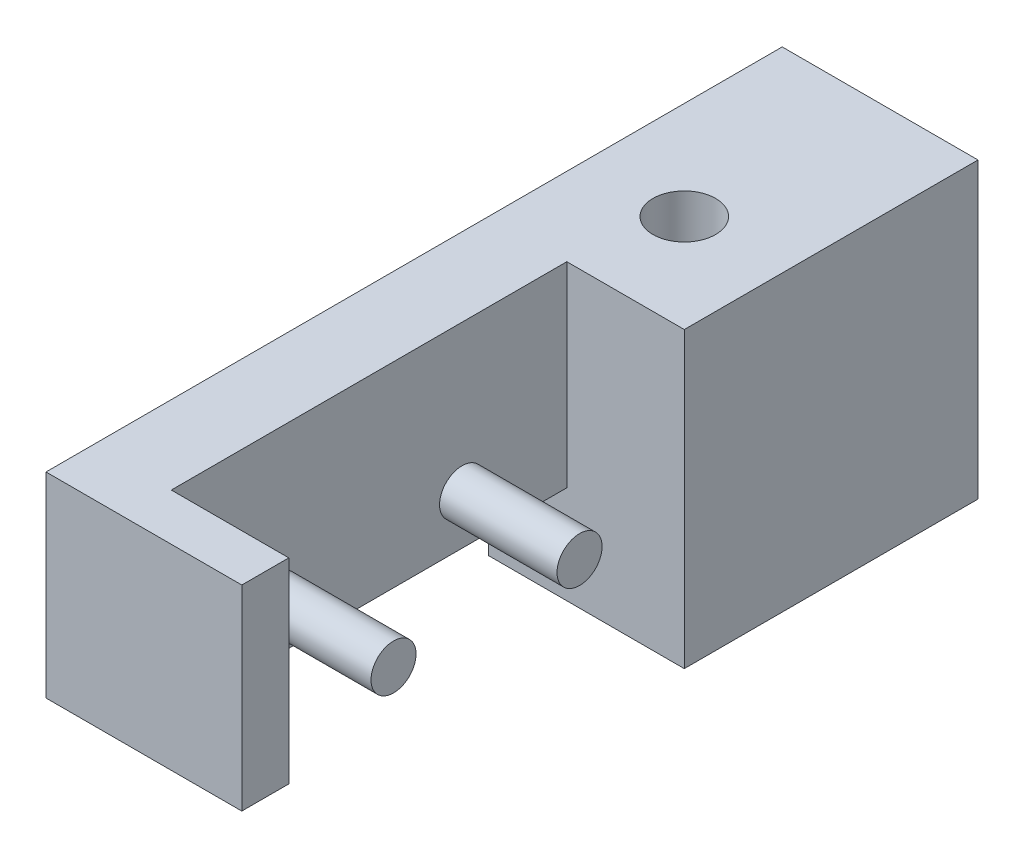
ISO-10303-21;
HEADER;
FILE_DESCRIPTION(('STEP AP214'),'2;1');
FILE_NAME('part.step','',(''),(''),'','','');
FILE_SCHEMA(('AUTOMOTIVE_DESIGN { 1 0 10303 214 1 1 1 1 }'));
ENDSEC;
DATA;
#1=APPLICATION_CONTEXT('core data for automotive mechanical design processes');
#2=APPLICATION_PROTOCOL_DEFINITION('international standard','automotive_design',2000,#1);
#3=PRODUCT_CONTEXT('',#1,'mechanical');
#4=PRODUCT('Part','Part','',(#3));
#5=PRODUCT_RELATED_PRODUCT_CATEGORY('part','',(#4));
#6=PRODUCT_DEFINITION_FORMATION('','',#4);
#7=PRODUCT_DEFINITION_CONTEXT('part definition',#1,'design');
#8=PRODUCT_DEFINITION('design','',#6,#7);
#9=PRODUCT_DEFINITION_SHAPE('','',#8);
#10=(LENGTH_UNIT() NAMED_UNIT(*) SI_UNIT(.MILLI.,.METRE.));
#11=(NAMED_UNIT(*) PLANE_ANGLE_UNIT() SI_UNIT($,.RADIAN.));
#12=(NAMED_UNIT(*) SI_UNIT($,.STERADIAN.) SOLID_ANGLE_UNIT());
#13=UNCERTAINTY_MEASURE_WITH_UNIT(LENGTH_MEASURE(1.E-05),#10,'distance_accuracy_value','');
#14=(GEOMETRIC_REPRESENTATION_CONTEXT(3) GLOBAL_UNCERTAINTY_ASSIGNED_CONTEXT((#13)) GLOBAL_UNIT_ASSIGNED_CONTEXT((#10,
#11,#12)) REPRESENTATION_CONTEXT('',''));
#15=CARTESIAN_POINT('',(0.,0.,0.));
#16=DIRECTION('',(0.,0.,1.));
#17=DIRECTION('',(1.,0.,0.));
#18=AXIS2_PLACEMENT_3D('',#15,#16,#17);
#19=CARTESIAN_POINT('',(5.,0.,0.));
#20=DIRECTION('',(1.,0.,0.));
#21=DIRECTION('',(0.,0.,-1.));
#22=AXIS2_PLACEMENT_3D('',#19,#20,#21);
#23=PLANE('',#22);
#24=DIRECTION('',(0.,-1.,0.));
#25=VECTOR('',#24,1.);
#26=CARTESIAN_POINT('',(5.,5.,20.2));
#27=LINE('',#26,#25);
#28=CARTESIAN_POINT('',(5.,15.,20.2));
#29=VERTEX_POINT('',#28);
#30=CARTESIAN_POINT('',(5.,5.,20.2));
#31=VERTEX_POINT('',#30);
#32=EDGE_CURVE('E202',#29,#31,#27,.T.);
#33=ORIENTED_EDGE('',*,*,#32,.F.);
#34=DIRECTION('',(0.,0.,1.));
#35=VECTOR('',#34,1.);
#36=CARTESIAN_POINT('',(5.,15.,-15.));
#37=LINE('',#36,#35);
#38=CARTESIAN_POINT('',(5.,15.,22.6));
#39=VERTEX_POINT('',#38);
#40=EDGE_CURVE('E115',#29,#39,#37,.T.);
#41=ORIENTED_EDGE('',*,*,#40,.T.);
#42=DIRECTION('',(0.,-1.,0.));
#43=VECTOR('',#42,1.);
#44=CARTESIAN_POINT('',(5.,15.,22.6));
#45=LINE('',#44,#43);
#46=CARTESIAN_POINT('',(5.,5.,22.6));
#47=VERTEX_POINT('',#46);
#48=EDGE_CURVE('E57',#39,#47,#45,.T.);
#49=ORIENTED_EDGE('',*,*,#48,.T.);
#50=DIRECTION('',(0.,0.,-1.));
#51=VECTOR('',#50,1.);
#52=CARTESIAN_POINT('',(5.,5.,22.6));
#53=LINE('',#52,#51);
#54=EDGE_CURVE('E138',#47,#31,#53,.T.);
#55=ORIENTED_EDGE('',*,*,#54,.T.);
#56=EDGE_LOOP('',(#33,#41,#49,#55));
#57=FACE_BOUND('',#56,.T.);
#58=ADVANCED_FACE('F39',(#57),#23,.T.);
#59=CARTESIAN_POINT('',(5.,0.,0.));
#60=DIRECTION('',(0.,1.,0.));
#61=DIRECTION('',(0.,0.,1.));
#62=AXIS2_PLACEMENT_3D('',#59,#60,#61);
#63=PLANE('',#62);
#64=CARTESIAN_POINT('',(0.,0.,-5.));
#65=DIRECTION('',(0.,-1.,0.));
#66=DIRECTION('',(0.,0.,-1.));
#67=AXIS2_PLACEMENT_3D('',#64,#65,#66);
#68=CIRCLE('',#67,1.6);
#69=CARTESIAN_POINT('',(0.,0.,-6.6));
#70=VERTEX_POINT('',#69);
#71=EDGE_CURVE('E380',#70,#70,#68,.T.);
#72=ORIENTED_EDGE('',*,*,#71,.F.);
#73=EDGE_LOOP('',(#72));
#74=FACE_BOUND('',#73,.T.);
#75=DIRECTION('',(0.,0.,-1.));
#76=VECTOR('',#75,1.);
#77=CARTESIAN_POINT('',(-5.,0.,0.));
#78=LINE('',#77,#76);
#79=CARTESIAN_POINT('',(-5.,0.,0.));
#80=VERTEX_POINT('',#79);
#81=CARTESIAN_POINT('',(-5.,0.,-15.));
#82=VERTEX_POINT('',#81);
#83=EDGE_CURVE('E144',#80,#82,#78,.T.);
#84=ORIENTED_EDGE('',*,*,#83,.T.);
#85=DIRECTION('',(-1.,0.,0.));
#86=VECTOR('',#85,1.);
#87=CARTESIAN_POINT('',(5.,0.,-15.));
#88=LINE('',#87,#86);
#89=CARTESIAN_POINT('',(5.,0.,-15.));
#90=VERTEX_POINT('',#89);
#91=EDGE_CURVE('E125',#90,#82,#88,.T.);
#92=ORIENTED_EDGE('',*,*,#91,.F.);
#93=DIRECTION('',(0.,0.,-1.));
#94=VECTOR('',#93,1.);
#95=CARTESIAN_POINT('',(5.,0.,0.));
#96=LINE('',#95,#94);
#97=CARTESIAN_POINT('',(5.,0.,0.));
#98=VERTEX_POINT('',#97);
#99=EDGE_CURVE('E96',#98,#90,#96,.T.);
#100=ORIENTED_EDGE('',*,*,#99,.F.);
#101=DIRECTION('',(-1.,0.,0.));
#102=VECTOR('',#101,1.);
#103=CARTESIAN_POINT('',(5.,0.,0.));
#104=LINE('',#103,#102);
#105=EDGE_CURVE('E171',#98,#80,#104,.T.);
#106=ORIENTED_EDGE('',*,*,#105,.T.);
#107=EDGE_LOOP('',(#84,#92,#100,#106));
#108=FACE_BOUND('',#107,.T.);
#109=ADVANCED_FACE('F41',(#74,#108),#63,.F.);
#110=CARTESIAN_POINT('',(5.,0.,-15.));
#111=DIRECTION('',(0.,0.,1.));
#112=DIRECTION('',(1.,0.,0.));
#113=AXIS2_PLACEMENT_3D('',#110,#111,#112);
#114=PLANE('',#113);
#115=DIRECTION('',(0.,1.,0.));
#116=VECTOR('',#115,1.);
#117=CARTESIAN_POINT('',(-5.,0.,-15.));
#118=LINE('',#117,#116);
#119=CARTESIAN_POINT('',(-5.,15.,-15.));
#120=VERTEX_POINT('',#119);
#121=EDGE_CURVE('E121',#82,#120,#118,.T.);
#122=ORIENTED_EDGE('',*,*,#121,.T.);
#123=DIRECTION('',(-1.,0.,0.));
#124=VECTOR('',#123,1.);
#125=CARTESIAN_POINT('',(5.,15.,-15.));
#126=LINE('',#125,#124);
#127=CARTESIAN_POINT('',(5.,15.,-15.));
#128=VERTEX_POINT('',#127);
#129=EDGE_CURVE('E118',#128,#120,#126,.T.);
#130=ORIENTED_EDGE('',*,*,#129,.F.);
#131=DIRECTION('',(0.,1.,0.));
#132=VECTOR('',#131,1.);
#133=CARTESIAN_POINT('',(5.,0.,-15.));
#134=LINE('',#133,#132);
#135=EDGE_CURVE('E106',#90,#128,#134,.T.);
#136=ORIENTED_EDGE('',*,*,#135,.F.);
#137=ORIENTED_EDGE('',*,*,#91,.T.);
#138=EDGE_LOOP('',(#122,#130,#136,#137));
#139=FACE_BOUND('',#138,.T.);
#140=ADVANCED_FACE('F119',(#139),#114,.F.);
#141=CARTESIAN_POINT('',(5.,15.,-15.));
#142=DIRECTION('',(0.,-1.,0.));
#143=DIRECTION('',(0.,0.,-1.));
#144=AXIS2_PLACEMENT_3D('',#141,#142,#143);
#145=PLANE('',#144);
#146=CARTESIAN_POINT('',(0.,15.,-5.));
#147=DIRECTION('',(0.,-1.,0.));
#148=DIRECTION('',(0.,0.,-1.));
#149=AXIS2_PLACEMENT_3D('',#146,#147,#148);
#150=CIRCLE('',#149,1.6);
#151=CARTESIAN_POINT('',(0.,15.,-6.6));
#152=VERTEX_POINT('',#151);
#153=EDGE_CURVE('E383',#152,#152,#150,.F.);
#154=ORIENTED_EDGE('',*,*,#153,.F.);
#155=EDGE_LOOP('',(#154));
#156=FACE_BOUND('',#155,.T.);
#157=ORIENTED_EDGE('',*,*,#40,.F.);
#158=DIRECTION('',(1.,0.,0.));
#159=VECTOR('',#158,1.);
#160=CARTESIAN_POINT('',(-1.,15.,20.2));
#161=LINE('',#160,#159);
#162=CARTESIAN_POINT('',(-1.,15.,20.2));
#163=VERTEX_POINT('',#162);
#164=EDGE_CURVE('E147',#163,#29,#161,.T.);
#165=ORIENTED_EDGE('',*,*,#164,.F.);
#166=DIRECTION('',(0.,0.,1.));
#167=VECTOR('',#166,1.);
#168=CARTESIAN_POINT('',(-1.,15.,20.2));
#169=LINE('',#168,#167);
#170=CARTESIAN_POINT('',(-1.,15.,0.));
#171=VERTEX_POINT('',#170);
#172=EDGE_CURVE('E195',#171,#163,#169,.T.);
#173=ORIENTED_EDGE('',*,*,#172,.F.);
#174=DIRECTION('',(1.,0.,0.));
#175=VECTOR('',#174,1.);
#176=CARTESIAN_POINT('',(-1.,15.,0.));
#177=LINE('',#176,#175);
#178=CARTESIAN_POINT('',(5.,15.,0.));
#179=VERTEX_POINT('',#178);
#180=EDGE_CURVE('E133',#171,#179,#177,.T.);
#181=ORIENTED_EDGE('',*,*,#180,.T.);
#182=EDGE_CURVE('E111',#128,#179,#37,.T.);
#183=ORIENTED_EDGE('',*,*,#182,.F.);
#184=ORIENTED_EDGE('',*,*,#129,.T.);
#185=DIRECTION('',(0.,0.,1.));
#186=VECTOR('',#185,1.);
#187=CARTESIAN_POINT('',(-5.,15.,-15.));
#188=LINE('',#187,#186);
#189=CARTESIAN_POINT('',(-5.,15.,22.6));
#190=VERTEX_POINT('',#189);
#191=EDGE_CURVE('E150',#120,#190,#188,.T.);
#192=ORIENTED_EDGE('',*,*,#191,.T.);
#193=DIRECTION('',(-1.,0.,0.));
#194=VECTOR('',#193,1.);
#195=CARTESIAN_POINT('',(5.,15.,22.6));
#196=LINE('',#195,#194);
#197=EDGE_CURVE('E126',#39,#190,#196,.T.);
#198=ORIENTED_EDGE('',*,*,#197,.F.);
#199=EDGE_LOOP('',(#157,#165,#173,#181,#183,#184,#192,#198));
#200=FACE_BOUND('',#199,.T.);
#201=ADVANCED_FACE('F130',(#156,#200),#145,.F.);
#202=CARTESIAN_POINT('',(5.,15.,22.6));
#203=DIRECTION('',(0.,0.,-1.));
#204=DIRECTION('',(0.,1.,0.));
#205=AXIS2_PLACEMENT_3D('',#202,#203,#204);
#206=PLANE('',#205);
#207=DIRECTION('',(0.,-1.,0.));
#208=VECTOR('',#207,1.);
#209=CARTESIAN_POINT('',(-5.,15.,22.6));
#210=LINE('',#209,#208);
#211=CARTESIAN_POINT('',(-5.,5.,22.6));
#212=VERTEX_POINT('',#211);
#213=EDGE_CURVE('E80',#190,#212,#210,.T.);
#214=ORIENTED_EDGE('',*,*,#213,.T.);
#215=DIRECTION('',(-1.,0.,0.));
#216=VECTOR('',#215,1.);
#217=CARTESIAN_POINT('',(5.,5.,22.6));
#218=LINE('',#217,#216);
#219=EDGE_CURVE('E164',#47,#212,#218,.T.);
#220=ORIENTED_EDGE('',*,*,#219,.F.);
#221=ORIENTED_EDGE('',*,*,#48,.F.);
#222=ORIENTED_EDGE('',*,*,#197,.T.);
#223=EDGE_LOOP('',(#214,#220,#221,#222));
#224=FACE_BOUND('',#223,.T.);
#225=ADVANCED_FACE('F240',(#224),#206,.F.);
#226=CARTESIAN_POINT('',(5.,5.,22.6));
#227=DIRECTION('',(0.,1.,0.));
#228=DIRECTION('',(0.,0.,1.));
#229=AXIS2_PLACEMENT_3D('',#226,#227,#228);
#230=PLANE('',#229);
#231=DIRECTION('',(0.,0.,-1.));
#232=VECTOR('',#231,1.);
#233=CARTESIAN_POINT('',(-1.,5.,20.2));
#234=LINE('',#233,#232);
#235=CARTESIAN_POINT('',(-1.,5.,20.2));
#236=VERTEX_POINT('',#235);
#237=CARTESIAN_POINT('',(-1.,5.,0.));
#238=VERTEX_POINT('',#237);
#239=EDGE_CURVE('E194',#236,#238,#234,.T.);
#240=ORIENTED_EDGE('',*,*,#239,.F.);
#241=DIRECTION('',(1.,0.,0.));
#242=VECTOR('',#241,1.);
#243=CARTESIAN_POINT('',(-1.,5.,20.2));
#244=LINE('',#243,#242);
#245=EDGE_CURVE('E209',#236,#31,#244,.T.);
#246=ORIENTED_EDGE('',*,*,#245,.T.);
#247=ORIENTED_EDGE('',*,*,#54,.F.);
#248=ORIENTED_EDGE('',*,*,#219,.T.);
#249=DIRECTION('',(0.,0.,-1.));
#250=VECTOR('',#249,1.);
#251=CARTESIAN_POINT('',(-5.,5.,22.6));
#252=LINE('',#251,#250);
#253=CARTESIAN_POINT('',(-5.,5.,0.));
#254=VERTEX_POINT('',#253);
#255=EDGE_CURVE('E155',#212,#254,#252,.T.);
#256=ORIENTED_EDGE('',*,*,#255,.T.);
#257=DIRECTION('',(-1.,0.,0.));
#258=VECTOR('',#257,1.);
#259=CARTESIAN_POINT('',(5.,5.,0.));
#260=LINE('',#259,#258);
#261=EDGE_CURVE('E87',#238,#254,#260,.T.);
#262=ORIENTED_EDGE('',*,*,#261,.F.);
#263=EDGE_LOOP('',(#240,#246,#247,#248,#256,#262));
#264=FACE_BOUND('',#263,.T.);
#265=ADVANCED_FACE('F206',(#264),#230,.F.);
#266=CARTESIAN_POINT('',(5.,5.,0.));
#267=DIRECTION('',(0.,0.,-1.));
#268=DIRECTION('',(-1.,0.,0.));
#269=AXIS2_PLACEMENT_3D('',#266,#267,#268);
#270=PLANE('',#269);
#271=DIRECTION('',(0.,-1.,0.));
#272=VECTOR('',#271,1.);
#273=CARTESIAN_POINT('',(-5.,5.,0.));
#274=LINE('',#273,#272);
#275=EDGE_CURVE('E158',#254,#80,#274,.T.);
#276=ORIENTED_EDGE('',*,*,#275,.T.);
#277=ORIENTED_EDGE('',*,*,#105,.F.);
#278=DIRECTION('',(0.,-1.,0.));
#279=VECTOR('',#278,1.);
#280=CARTESIAN_POINT('',(5.,4.,0.));
#281=LINE('',#280,#279);
#282=EDGE_CURVE('E161',#179,#98,#281,.T.);
#283=ORIENTED_EDGE('',*,*,#282,.F.);
#284=ORIENTED_EDGE('',*,*,#180,.F.);
#285=DIRECTION('',(0.,1.,0.));
#286=VECTOR('',#285,1.);
#287=CARTESIAN_POINT('',(-1.,5.,0.));
#288=LINE('',#287,#286);
#289=EDGE_CURVE('E211',#238,#171,#288,.T.);
#290=ORIENTED_EDGE('',*,*,#289,.F.);
#291=ORIENTED_EDGE('',*,*,#261,.T.);
#292=EDGE_LOOP('',(#276,#277,#283,#284,#290,#291));
#293=FACE_BOUND('',#292,.T.);
#294=ADVANCED_FACE('F233',(#293),#270,.F.);
#295=ORIENTED_EDGE('',*,*,#182,.T.);
#296=ORIENTED_EDGE('',*,*,#282,.T.);
#297=ORIENTED_EDGE('',*,*,#99,.T.);
#298=ORIENTED_EDGE('',*,*,#135,.T.);
#299=EDGE_LOOP('',(#295,#296,#297,#298));
#300=FACE_BOUND('',#299,.T.);
#301=ADVANCED_FACE('F108',(#300),#23,.T.);
#302=CARTESIAN_POINT('',(-5.,0.,0.));
#303=DIRECTION('',(1.,0.,0.));
#304=DIRECTION('',(0.,0.,-1.));
#305=AXIS2_PLACEMENT_3D('',#302,#303,#304);
#306=PLANE('',#305);
#307=ORIENTED_EDGE('',*,*,#83,.F.);
#308=ORIENTED_EDGE('',*,*,#275,.F.);
#309=ORIENTED_EDGE('',*,*,#255,.F.);
#310=ORIENTED_EDGE('',*,*,#213,.F.);
#311=ORIENTED_EDGE('',*,*,#191,.F.);
#312=ORIENTED_EDGE('',*,*,#121,.F.);
#313=EDGE_LOOP('',(#307,#308,#309,#310,#311,#312));
#314=FACE_BOUND('',#313,.T.);
#315=ADVANCED_FACE('F237',(#314),#306,.F.);
#316=CARTESIAN_POINT('',(-1.,5.,20.2));
#317=DIRECTION('',(0.,0.,1.));
#318=DIRECTION('',(1.,0.,0.));
#319=AXIS2_PLACEMENT_3D('',#316,#317,#318);
#320=PLANE('',#319);
#321=ORIENTED_EDGE('',*,*,#32,.T.);
#322=ORIENTED_EDGE('',*,*,#245,.F.);
#323=DIRECTION('',(0.,-1.,0.));
#324=VECTOR('',#323,1.);
#325=CARTESIAN_POINT('',(-1.,5.,20.2));
#326=LINE('',#325,#324);
#327=EDGE_CURVE('E190',#163,#236,#326,.T.);
#328=ORIENTED_EDGE('',*,*,#327,.F.);
#329=ORIENTED_EDGE('',*,*,#164,.T.);
#330=EDGE_LOOP('',(#321,#322,#328,#329));
#331=FACE_BOUND('',#330,.T.);
#332=ADVANCED_FACE('F182',(#331),#320,.F.);
#333=CARTESIAN_POINT('',(-1.,0.,0.));
#334=DIRECTION('',(-1.,0.,0.));
#335=DIRECTION('',(0.,0.,1.));
#336=AXIS2_PLACEMENT_3D('',#333,#334,#335);
#337=PLANE('',#336);
#338=CARTESIAN_POINT('',(-1.,7.5,5.35000000000001));
#339=DIRECTION('',(-1.,0.,0.));
#340=DIRECTION('',(0.,0.,1.));
#341=AXIS2_PLACEMENT_3D('',#338,#339,#340);
#342=CIRCLE('',#341,1.15);
#343=CARTESIAN_POINT('',(-1.,7.5,6.50000000000001));
#344=VERTEX_POINT('',#343);
#345=EDGE_CURVE('E11',#344,#344,#342,.F.);
#346=ORIENTED_EDGE('',*,*,#345,.F.);
#347=EDGE_LOOP('',(#346));
#348=FACE_BOUND('',#347,.T.);
#349=CARTESIAN_POINT('',(-1.,7.5,14.85));
#350=DIRECTION('',(-1.,0.,0.));
#351=DIRECTION('',(0.,0.,1.));
#352=AXIS2_PLACEMENT_3D('',#349,#350,#351);
#353=CIRCLE('',#352,1.15);
#354=CARTESIAN_POINT('',(-1.,7.5,16.));
#355=VERTEX_POINT('',#354);
#356=EDGE_CURVE('E49',#355,#355,#353,.F.);
#357=ORIENTED_EDGE('',*,*,#356,.F.);
#358=EDGE_LOOP('',(#357));
#359=FACE_BOUND('',#358,.T.);
#360=ORIENTED_EDGE('',*,*,#327,.T.);
#361=ORIENTED_EDGE('',*,*,#239,.T.);
#362=ORIENTED_EDGE('',*,*,#289,.T.);
#363=ORIENTED_EDGE('',*,*,#172,.T.);
#364=EDGE_LOOP('',(#360,#361,#362,#363));
#365=FACE_BOUND('',#364,.T.);
#366=ADVANCED_FACE('F179',(#348,#359,#365),#337,.F.);
#367=CARTESIAN_POINT('',(5.,7.5,14.85));
#368=DIRECTION('',(-1.,0.,0.));
#369=DIRECTION('',(0.,0.,1.));
#370=AXIS2_PLACEMENT_3D('',#367,#368,#369);
#371=CYLINDRICAL_SURFACE('',#370,1.15);
#372=CARTESIAN_POINT('',(5.,7.5,14.85));
#373=DIRECTION('',(1.,0.,0.));
#374=DIRECTION('',(0.,0.,-1.));
#375=AXIS2_PLACEMENT_3D('',#372,#373,#374);
#376=CIRCLE('',#375,1.15);
#377=CARTESIAN_POINT('',(5.,7.5,13.7));
#378=VERTEX_POINT('',#377);
#379=EDGE_CURVE('E222',#378,#378,#376,.T.);
#380=ORIENTED_EDGE('',*,*,#379,.F.);
#381=EDGE_LOOP('',(#380));
#382=FACE_BOUND('',#381,.T.);
#383=ORIENTED_EDGE('',*,*,#356,.T.);
#384=EDGE_LOOP('',(#383));
#385=FACE_BOUND('',#384,.T.);
#386=ADVANCED_FACE('F177',(#382,#385),#371,.T.);
#387=CARTESIAN_POINT('',(5.,7.5,14.85));
#388=DIRECTION('',(1.,0.,0.));
#389=DIRECTION('',(0.,0.,-1.));
#390=AXIS2_PLACEMENT_3D('',#387,#388,#389);
#391=PLANE('',#390);
#392=ORIENTED_EDGE('',*,*,#379,.T.);
#393=EDGE_LOOP('',(#392));
#394=FACE_BOUND('',#393,.T.);
#395=ADVANCED_FACE('F324',(#394),#391,.T.);
#396=CARTESIAN_POINT('',(5.,7.5,5.35000000000001));
#397=DIRECTION('',(-1.,0.,0.));
#398=DIRECTION('',(0.,0.,1.));
#399=AXIS2_PLACEMENT_3D('',#396,#397,#398);
#400=CYLINDRICAL_SURFACE('',#399,1.15);
#401=CARTESIAN_POINT('',(5.,7.5,5.35000000000001));
#402=DIRECTION('',(1.,0.,0.));
#403=DIRECTION('',(0.,0.,-1.));
#404=AXIS2_PLACEMENT_3D('',#401,#402,#403);
#405=CIRCLE('',#404,1.15);
#406=CARTESIAN_POINT('',(5.,7.5,4.20000000000001));
#407=VERTEX_POINT('',#406);
#408=EDGE_CURVE('E385',#407,#407,#405,.T.);
#409=ORIENTED_EDGE('',*,*,#408,.F.);
#410=EDGE_LOOP('',(#409));
#411=FACE_BOUND('',#410,.T.);
#412=ORIENTED_EDGE('',*,*,#345,.T.);
#413=EDGE_LOOP('',(#412));
#414=FACE_BOUND('',#413,.T.);
#415=ADVANCED_FACE('F334',(#411,#414),#400,.T.);
#416=CARTESIAN_POINT('',(5.,7.5,5.35000000000001));
#417=DIRECTION('',(1.,0.,0.));
#418=DIRECTION('',(0.,0.,-1.));
#419=AXIS2_PLACEMENT_3D('',#416,#417,#418);
#420=PLANE('',#419);
#421=ORIENTED_EDGE('',*,*,#408,.T.);
#422=EDGE_LOOP('',(#421));
#423=FACE_BOUND('',#422,.T.);
#424=ADVANCED_FACE('F344',(#423),#420,.T.);
#425=CARTESIAN_POINT('',(0.,15.001,-5.));
#426=DIRECTION('',(0.,-1.,0.));
#427=DIRECTION('',(0.,0.,-1.));
#428=AXIS2_PLACEMENT_3D('',#425,#426,#427);
#429=CYLINDRICAL_SURFACE('',#428,1.6);
#430=ORIENTED_EDGE('',*,*,#71,.T.);
#431=EDGE_LOOP('',(#430));
#432=FACE_BOUND('',#431,.T.);
#433=ORIENTED_EDGE('',*,*,#153,.T.);
#434=EDGE_LOOP('',(#433));
#435=FACE_BOUND('',#434,.T.);
#436=ADVANCED_FACE('F353',(#432,#435),#429,.F.);
#437=CLOSED_SHELL('',(#58,#109,#140,#201,#225,#265,#294,#301,#315,#332,#366,#386,#395,#415,#424,#436));
#438=MANIFOLD_SOLID_BREP('B2',#437);
#439=ADVANCED_BREP_SHAPE_REPRESENTATION('',(#18,#438),#14);
#440=SHAPE_DEFINITION_REPRESENTATION(#9,#439);
ENDSEC;
END-ISO-10303-21;
